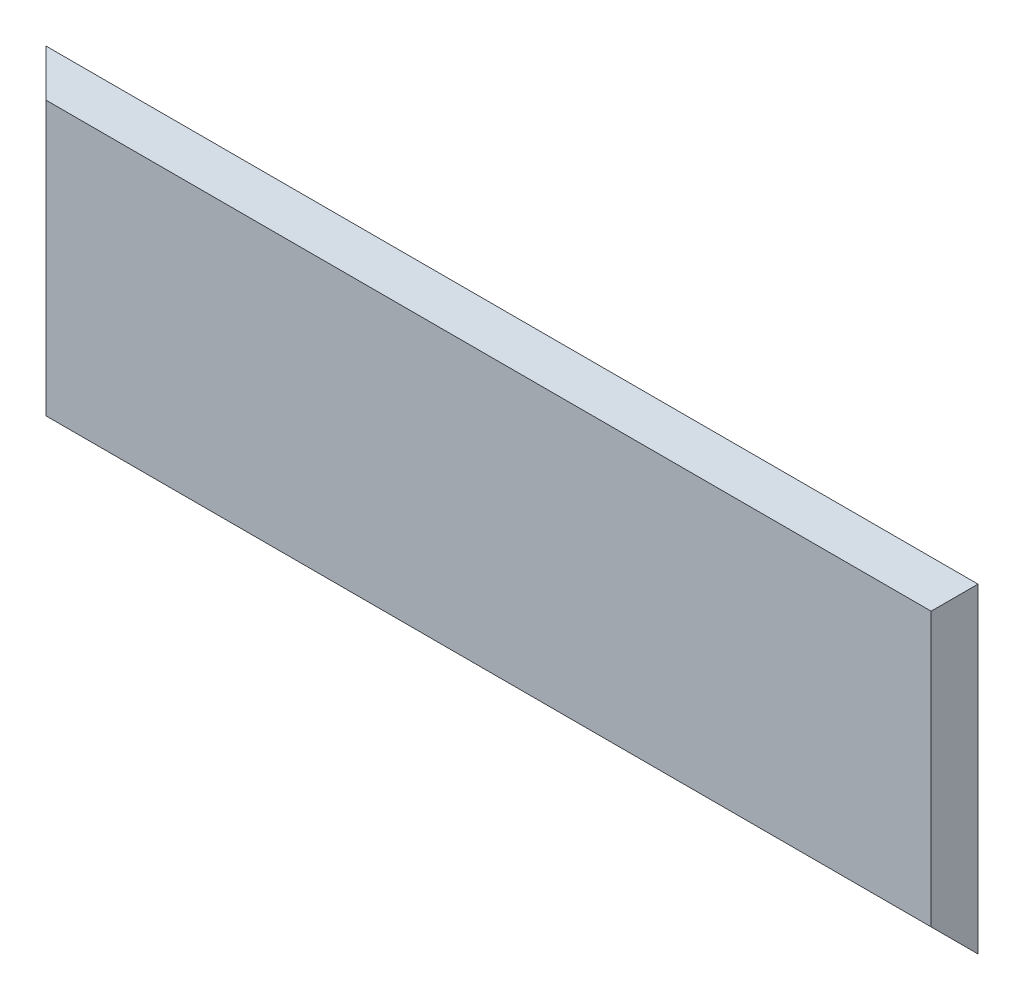
ISO-10303-21;
HEADER;
FILE_DESCRIPTION(('STEP AP214'),'2;1');
FILE_NAME('part.step','',(''),(''),'','','');
FILE_SCHEMA(('AUTOMOTIVE_DESIGN { 1 0 10303 214 1 1 1 1 }'));
ENDSEC;
DATA;
#1=APPLICATION_CONTEXT('core data for automotive mechanical design processes');
#2=APPLICATION_PROTOCOL_DEFINITION('international standard','automotive_design',2000,#1);
#3=PRODUCT_CONTEXT('',#1,'mechanical');
#4=PRODUCT('Part','Part','',(#3));
#5=PRODUCT_RELATED_PRODUCT_CATEGORY('part','',(#4));
#6=PRODUCT_DEFINITION_FORMATION('','',#4);
#7=PRODUCT_DEFINITION_CONTEXT('part definition',#1,'design');
#8=PRODUCT_DEFINITION('design','',#6,#7);
#9=PRODUCT_DEFINITION_SHAPE('','',#8);
#10=(LENGTH_UNIT() NAMED_UNIT(*) SI_UNIT(.MILLI.,.METRE.));
#11=(NAMED_UNIT(*) PLANE_ANGLE_UNIT() SI_UNIT($,.RADIAN.));
#12=(NAMED_UNIT(*) SI_UNIT($,.STERADIAN.) SOLID_ANGLE_UNIT());
#13=UNCERTAINTY_MEASURE_WITH_UNIT(LENGTH_MEASURE(1.E-05),#10,'distance_accuracy_value','');
#14=(GEOMETRIC_REPRESENTATION_CONTEXT(3) GLOBAL_UNCERTAINTY_ASSIGNED_CONTEXT((#13)) GLOBAL_UNIT_ASSIGNED_CONTEXT((#10,
#11,#12)) REPRESENTATION_CONTEXT('',''));
#15=CARTESIAN_POINT('',(0.,0.,0.));
#16=DIRECTION('',(0.,0.,1.));
#17=DIRECTION('',(1.,0.,0.));
#18=AXIS2_PLACEMENT_3D('',#15,#16,#17);
#19=CARTESIAN_POINT('',(2.89125,1.396875,0.52));
#20=DIRECTION('',(0.,0.707106781186547,0.707106781186548));
#21=DIRECTION('',(0.577350269189626,-0.577350269189626,0.577350269189626));
#22=AXIS2_PLACEMENT_3D('',#19,#20,#21);
#23=PLANE('',#22);
#24=DIRECTION('',(-1.,0.,0.));
#25=VECTOR('',#24,1.);
#26=CARTESIAN_POINT('',(2.89125,1.396875,0.52));
#27=LINE('',#26,#25);
#28=CARTESIAN_POINT('',(2.89125,1.396875,0.52));
#29=VERTEX_POINT('',#28);
#30=CARTESIAN_POINT('',(-0.29125,1.396875,0.52));
#31=VERTEX_POINT('',#30);
#32=EDGE_CURVE('E11',#29,#31,#27,.T.);
#33=ORIENTED_EDGE('',*,*,#32,.T.);
#34=DIRECTION('',(0.577350269189626,-0.577350269189626,0.577350269189625));
#35=VECTOR('',#34,1.);
#36=CARTESIAN_POINT('',(-0.29125,1.396875,0.52));
#37=LINE('',#36,#35);
#38=CARTESIAN_POINT('',(-0.21125,1.316875,0.6));
#39=VERTEX_POINT('',#38);
#40=EDGE_CURVE('E26',#31,#39,#37,.T.);
#41=ORIENTED_EDGE('',*,*,#40,.T.);
#42=DIRECTION('',(-1.,0.,0.));
#43=VECTOR('',#42,1.);
#44=CARTESIAN_POINT('',(2.81125,1.316875,0.6));
#45=LINE('',#44,#43);
#46=CARTESIAN_POINT('',(2.81125,1.316875,0.6));
#47=VERTEX_POINT('',#46);
#48=EDGE_CURVE('E78',#47,#39,#45,.T.);
#49=ORIENTED_EDGE('',*,*,#48,.F.);
#50=DIRECTION('',(-0.577350269189626,-0.577350269189627,0.577350269189625));
#51=VECTOR('',#50,1.);
#52=CARTESIAN_POINT('',(2.89125,1.396875,0.52));
#53=LINE('',#52,#51);
#54=EDGE_CURVE('E75',#29,#47,#53,.T.);
#55=ORIENTED_EDGE('',*,*,#54,.F.);
#56=EDGE_LOOP('',(#33,#41,#49,#55));
#57=FACE_BOUND('',#56,.T.);
#58=ADVANCED_FACE('F16',(#57),#23,.T.);
#59=CARTESIAN_POINT('',(-0.29125,1.396875,0.52));
#60=DIRECTION('',(-0.707106781186547,0.,0.707106781186548));
#61=DIRECTION('',(0.577350269189626,0.577350269189626,0.577350269189626));
#62=AXIS2_PLACEMENT_3D('',#59,#60,#61);
#63=PLANE('',#62);
#64=DIRECTION('',(0.,-1.,0.));
#65=VECTOR('',#64,1.);
#66=CARTESIAN_POINT('',(-0.29125,1.396875,0.52));
#67=LINE('',#66,#65);
#68=CARTESIAN_POINT('',(-0.29125,0.303125,0.52));
#69=VERTEX_POINT('',#68);
#70=EDGE_CURVE('E83',#31,#69,#67,.T.);
#71=ORIENTED_EDGE('',*,*,#70,.T.);
#72=DIRECTION('',(0.577350269189626,0.577350269189626,0.577350269189626));
#73=VECTOR('',#72,1.);
#74=CARTESIAN_POINT('',(-0.29125,0.303125,0.52));
#75=LINE('',#74,#73);
#76=CARTESIAN_POINT('',(-0.21125,0.383125,0.6));
#77=VERTEX_POINT('',#76);
#78=EDGE_CURVE('E85',#69,#77,#75,.T.);
#79=ORIENTED_EDGE('',*,*,#78,.T.);
#80=DIRECTION('',(0.,-1.,0.));
#81=VECTOR('',#80,1.);
#82=CARTESIAN_POINT('',(-0.21125,1.316875,0.6));
#83=LINE('',#82,#81);
#84=EDGE_CURVE('E62',#39,#77,#83,.T.);
#85=ORIENTED_EDGE('',*,*,#84,.F.);
#86=ORIENTED_EDGE('',*,*,#40,.F.);
#87=EDGE_LOOP('',(#71,#79,#85,#86));
#88=FACE_BOUND('',#87,.T.);
#89=ADVANCED_FACE('F88',(#88),#63,.T.);
#90=CARTESIAN_POINT('',(-0.29125,0.303125,0.52));
#91=DIRECTION('',(0.,-0.707106781186547,0.707106781186548));
#92=DIRECTION('',(0.577350269189626,0.577350269189626,0.577350269189626));
#93=AXIS2_PLACEMENT_3D('',#90,#91,#92);
#94=PLANE('',#93);
#95=DIRECTION('',(1.,0.,0.));
#96=VECTOR('',#95,1.);
#97=CARTESIAN_POINT('',(-0.29125,0.303125,0.52));
#98=LINE('',#97,#96);
#99=CARTESIAN_POINT('',(2.89125,0.303125,0.52));
#100=VERTEX_POINT('',#99);
#101=EDGE_CURVE('E68',#69,#100,#98,.T.);
#102=ORIENTED_EDGE('',*,*,#101,.T.);
#103=DIRECTION('',(-0.577350269189628,0.577350269189625,0.577350269189624));
#104=VECTOR('',#103,1.);
#105=CARTESIAN_POINT('',(2.89125,0.303125,0.52));
#106=LINE('',#105,#104);
#107=CARTESIAN_POINT('',(2.81125,0.383125,0.6));
#108=VERTEX_POINT('',#107);
#109=EDGE_CURVE('E54',#100,#108,#106,.T.);
#110=ORIENTED_EDGE('',*,*,#109,.T.);
#111=DIRECTION('',(1.,0.,0.));
#112=VECTOR('',#111,1.);
#113=CARTESIAN_POINT('',(-0.21125,0.383125,0.6));
#114=LINE('',#113,#112);
#115=EDGE_CURVE('E60',#77,#108,#114,.T.);
#116=ORIENTED_EDGE('',*,*,#115,.F.);
#117=ORIENTED_EDGE('',*,*,#78,.F.);
#118=EDGE_LOOP('',(#102,#110,#116,#117));
#119=FACE_BOUND('',#118,.T.);
#120=ADVANCED_FACE('F66',(#119),#94,.T.);
#121=CARTESIAN_POINT('',(2.89125,0.303125,0.52));
#122=DIRECTION('',(0.707106781186547,0.,0.707106781186548));
#123=DIRECTION('',(-0.577350269189626,0.577350269189626,0.577350269189626));
#124=AXIS2_PLACEMENT_3D('',#121,#122,#123);
#125=PLANE('',#124);
#126=DIRECTION('',(0.,1.,0.));
#127=VECTOR('',#126,1.);
#128=CARTESIAN_POINT('',(2.89125,0.303125,0.52));
#129=LINE('',#128,#127);
#130=EDGE_CURVE('E70',#100,#29,#129,.T.);
#131=ORIENTED_EDGE('',*,*,#130,.T.);
#132=ORIENTED_EDGE('',*,*,#54,.T.);
#133=DIRECTION('',(0.,1.,0.));
#134=VECTOR('',#133,1.);
#135=CARTESIAN_POINT('',(2.81125,0.383125,0.6));
#136=LINE('',#135,#134);
#137=EDGE_CURVE('E20',#108,#47,#136,.T.);
#138=ORIENTED_EDGE('',*,*,#137,.F.);
#139=ORIENTED_EDGE('',*,*,#109,.F.);
#140=EDGE_LOOP('',(#131,#132,#138,#139));
#141=FACE_BOUND('',#140,.T.);
#142=ADVANCED_FACE('F73',(#141),#125,.T.);
#143=CARTESIAN_POINT('',(0.,0.,0.6));
#144=DIRECTION('',(0.,0.,1.));
#145=DIRECTION('',(0.707106781186548,0.707106781186548,0.));
#146=AXIS2_PLACEMENT_3D('',#143,#144,#145);
#147=PLANE('',#146);
#148=ORIENTED_EDGE('',*,*,#48,.T.);
#149=ORIENTED_EDGE('',*,*,#84,.T.);
#150=ORIENTED_EDGE('',*,*,#115,.T.);
#151=ORIENTED_EDGE('',*,*,#137,.T.);
#152=EDGE_LOOP('',(#148,#149,#150,#151));
#153=FACE_BOUND('',#152,.T.);
#154=ADVANCED_FACE('F61',(#153),#147,.T.);
#155=CARTESIAN_POINT('',(0.,0.,0.52));
#156=DIRECTION('',(0.,0.,1.));
#157=DIRECTION('',(0.707106781186548,0.707106781186548,0.));
#158=AXIS2_PLACEMENT_3D('',#155,#156,#157);
#159=PLANE('',#158);
#160=ORIENTED_EDGE('',*,*,#130,.F.);
#161=ORIENTED_EDGE('',*,*,#101,.F.);
#162=ORIENTED_EDGE('',*,*,#70,.F.);
#163=ORIENTED_EDGE('',*,*,#32,.F.);
#164=EDGE_LOOP('',(#160,#161,#162,#163));
#165=FACE_BOUND('',#164,.T.);
#166=ADVANCED_FACE('F18',(#165),#159,.F.);
#167=CLOSED_SHELL('',(#58,#89,#120,#142,#154,#166));
#168=MANIFOLD_SOLID_BREP('B1',#167);
#169=ADVANCED_BREP_SHAPE_REPRESENTATION('',(#18,#168),#14);
#170=SHAPE_DEFINITION_REPRESENTATION(#9,#169);
ENDSEC;
END-ISO-10303-21;
